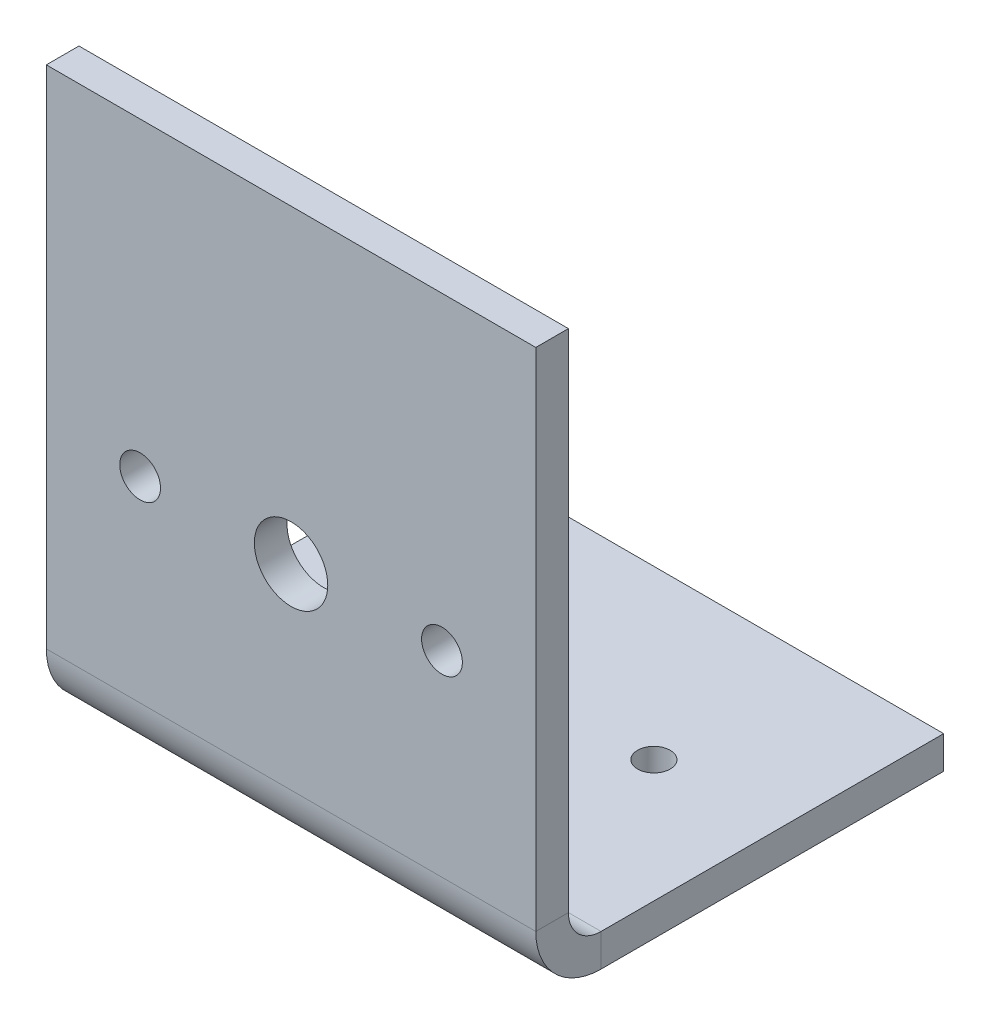
ISO-10303-21;
HEADER;
FILE_DESCRIPTION(('STEP AP214'),'2;1');
FILE_NAME('part.step','',(''),(''),'','','');
FILE_SCHEMA(('AUTOMOTIVE_DESIGN { 1 0 10303 214 1 1 1 1 }'));
ENDSEC;
DATA;
#1=APPLICATION_CONTEXT('core data for automotive mechanical design processes');
#2=APPLICATION_PROTOCOL_DEFINITION('international standard','automotive_design',2000,#1);
#3=PRODUCT_CONTEXT('',#1,'mechanical');
#4=PRODUCT('Part','Part','',(#3));
#5=PRODUCT_RELATED_PRODUCT_CATEGORY('part','',(#4));
#6=PRODUCT_DEFINITION_FORMATION('','',#4);
#7=PRODUCT_DEFINITION_CONTEXT('part definition',#1,'design');
#8=PRODUCT_DEFINITION('design','',#6,#7);
#9=PRODUCT_DEFINITION_SHAPE('','',#8);
#10=(LENGTH_UNIT() NAMED_UNIT(*) SI_UNIT(.MILLI.,.METRE.));
#11=(NAMED_UNIT(*) PLANE_ANGLE_UNIT() SI_UNIT($,.RADIAN.));
#12=(NAMED_UNIT(*) SI_UNIT($,.STERADIAN.) SOLID_ANGLE_UNIT());
#13=UNCERTAINTY_MEASURE_WITH_UNIT(LENGTH_MEASURE(1.E-05),#10,'distance_accuracy_value','');
#14=(GEOMETRIC_REPRESENTATION_CONTEXT(3) GLOBAL_UNCERTAINTY_ASSIGNED_CONTEXT((#13)) GLOBAL_UNIT_ASSIGNED_CONTEXT((#10,
#11,#12)) REPRESENTATION_CONTEXT('',''));
#15=CARTESIAN_POINT('',(0.,0.,0.));
#16=DIRECTION('',(0.,0.,1.));
#17=DIRECTION('',(1.,0.,0.));
#18=AXIS2_PLACEMENT_3D('',#15,#16,#17);
#19=CARTESIAN_POINT('',(0.,70.,-4.));
#20=DIRECTION('',(1.,0.,0.));
#21=DIRECTION('',(0.,1.,0.));
#22=AXIS2_PLACEMENT_3D('',#19,#20,#21);
#23=PLANE('',#22);
#24=DIRECTION('',(0.,0.,-1.));
#25=VECTOR('',#24,1.);
#26=CARTESIAN_POINT('',(0.,8.,-4.));
#27=LINE('',#26,#25);
#28=CARTESIAN_POINT('',(0.,8.,0.));
#29=VERTEX_POINT('',#28);
#30=CARTESIAN_POINT('',(0.,8.,-4.));
#31=VERTEX_POINT('',#30);
#32=EDGE_CURVE('E11',#29,#31,#27,.T.);
#33=ORIENTED_EDGE('',*,*,#32,.F.);
#34=DIRECTION('',(0.,-1.,0.));
#35=VECTOR('',#34,1.);
#36=CARTESIAN_POINT('',(0.,70.,0.));
#37=LINE('',#36,#35);
#38=CARTESIAN_POINT('',(0.,70.,0.));
#39=VERTEX_POINT('',#38);
#40=EDGE_CURVE('E92',#29,#39,#37,.F.);
#41=ORIENTED_EDGE('',*,*,#40,.T.);
#42=DIRECTION('',(0.,0.,-1.));
#43=VECTOR('',#42,1.);
#44=CARTESIAN_POINT('',(0.,70.,-4.));
#45=LINE('',#44,#43);
#46=CARTESIAN_POINT('',(0.,70.,-4.));
#47=VERTEX_POINT('',#46);
#48=EDGE_CURVE('E51',#39,#47,#45,.T.);
#49=ORIENTED_EDGE('',*,*,#48,.T.);
#50=DIRECTION('',(0.,1.,0.));
#51=VECTOR('',#50,1.);
#52=CARTESIAN_POINT('',(0.,70.,-4.));
#53=LINE('',#52,#51);
#54=EDGE_CURVE('E95',#31,#47,#53,.T.);
#55=ORIENTED_EDGE('',*,*,#54,.F.);
#56=EDGE_LOOP('',(#33,#41,#49,#55));
#57=FACE_BOUND('',#56,.T.);
#58=ADVANCED_FACE('F40',(#57),#23,.F.);
#59=CARTESIAN_POINT('',(60.,70.,-4.));
#60=DIRECTION('',(0.,1.,0.));
#61=DIRECTION('',(-1.,0.,0.));
#62=AXIS2_PLACEMENT_3D('',#59,#60,#61);
#63=PLANE('',#62);
#64=ORIENTED_EDGE('',*,*,#48,.F.);
#65=DIRECTION('',(1.,0.,0.));
#66=VECTOR('',#65,1.);
#67=CARTESIAN_POINT('',(60.,70.,0.));
#68=LINE('',#67,#66);
#69=CARTESIAN_POINT('',(60.,70.,0.));
#70=VERTEX_POINT('',#69);
#71=EDGE_CURVE('E121',#70,#39,#68,.F.);
#72=ORIENTED_EDGE('',*,*,#71,.F.);
#73=DIRECTION('',(0.,0.,-1.));
#74=VECTOR('',#73,1.);
#75=CARTESIAN_POINT('',(60.,70.,-4.));
#76=LINE('',#75,#74);
#77=CARTESIAN_POINT('',(60.,70.,-4.));
#78=VERTEX_POINT('',#77);
#79=EDGE_CURVE('E153',#70,#78,#76,.T.);
#80=ORIENTED_EDGE('',*,*,#79,.T.);
#81=DIRECTION('',(-1.,0.,0.));
#82=VECTOR('',#81,1.);
#83=CARTESIAN_POINT('',(60.,70.,-4.));
#84=LINE('',#83,#82);
#85=EDGE_CURVE('E202',#78,#47,#84,.T.);
#86=ORIENTED_EDGE('',*,*,#85,.T.);
#87=EDGE_LOOP('',(#64,#72,#80,#86));
#88=FACE_BOUND('',#87,.T.);
#89=ADVANCED_FACE('F278',(#88),#63,.T.);
#90=CARTESIAN_POINT('',(60.,70.,-4.));
#91=DIRECTION('',(1.,0.,0.));
#92=DIRECTION('',(0.,1.,0.));
#93=AXIS2_PLACEMENT_3D('',#90,#91,#92);
#94=PLANE('',#93);
#95=ORIENTED_EDGE('',*,*,#79,.F.);
#96=DIRECTION('',(0.,-1.,0.));
#97=VECTOR('',#96,1.);
#98=CARTESIAN_POINT('',(60.,70.,0.));
#99=LINE('',#98,#97);
#100=CARTESIAN_POINT('',(60.,8.,0.));
#101=VERTEX_POINT('',#100);
#102=EDGE_CURVE('E240',#101,#70,#99,.F.);
#103=ORIENTED_EDGE('',*,*,#102,.F.);
#104=DIRECTION('',(0.,0.,-1.));
#105=VECTOR('',#104,1.);
#106=CARTESIAN_POINT('',(60.,8.,-4.));
#107=LINE('',#106,#105);
#108=CARTESIAN_POINT('',(60.,8.,-4.));
#109=VERTEX_POINT('',#108);
#110=EDGE_CURVE('E149',#101,#109,#107,.T.);
#111=ORIENTED_EDGE('',*,*,#110,.T.);
#112=DIRECTION('',(0.,1.,0.));
#113=VECTOR('',#112,1.);
#114=CARTESIAN_POINT('',(60.,70.,-4.));
#115=LINE('',#114,#113);
#116=EDGE_CURVE('E207',#109,#78,#115,.T.);
#117=ORIENTED_EDGE('',*,*,#116,.T.);
#118=EDGE_LOOP('',(#95,#103,#111,#117));
#119=FACE_BOUND('',#118,.T.);
#120=ADVANCED_FACE('F313',(#119),#94,.T.);
#121=CARTESIAN_POINT('',(60.,8.,-8.00000000000001));
#122=DIRECTION('',(1.,0.,0.));
#123=DIRECTION('',(0.,0.,-1.));
#124=AXIS2_PLACEMENT_3D('',#121,#122,#123);
#125=PLANE('',#124);
#126=ORIENTED_EDGE('',*,*,#110,.F.);
#127=CARTESIAN_POINT('',(60.,8.,-8.00000000000001));
#128=DIRECTION('',(1.,0.,0.));
#129=DIRECTION('',(0.,0.,-1.));
#130=AXIS2_PLACEMENT_3D('',#127,#128,#129);
#131=CIRCLE('',#130,8.);
#132=CARTESIAN_POINT('',(60.,0.,-8.));
#133=VERTEX_POINT('',#132);
#134=EDGE_CURVE('E110',#101,#133,#131,.T.);
#135=ORIENTED_EDGE('',*,*,#134,.T.);
#136=DIRECTION('',(0.,1.,0.));
#137=VECTOR('',#136,1.);
#138=CARTESIAN_POINT('',(60.,4.,-8.00000000000001));
#139=LINE('',#138,#137);
#140=CARTESIAN_POINT('',(60.,4.,-8.00000000000001));
#141=VERTEX_POINT('',#140);
#142=EDGE_CURVE('E60',#133,#141,#139,.T.);
#143=ORIENTED_EDGE('',*,*,#142,.T.);
#144=CARTESIAN_POINT('',(60.,8.,-8.00000000000001));
#145=DIRECTION('',(-1.,0.,0.));
#146=DIRECTION('',(0.,0.,1.));
#147=AXIS2_PLACEMENT_3D('',#144,#145,#146);
#148=CIRCLE('',#147,4.);
#149=EDGE_CURVE('E203',#109,#141,#148,.F.);
#150=ORIENTED_EDGE('',*,*,#149,.F.);
#151=EDGE_LOOP('',(#126,#135,#143,#150));
#152=FACE_BOUND('',#151,.T.);
#153=ADVANCED_FACE('F311',(#152),#125,.T.);
#154=CARTESIAN_POINT('',(60.,4.,-4.00000000000001));
#155=DIRECTION('',(1.,0.,0.));
#156=DIRECTION('',(0.,0.,1.));
#157=AXIS2_PLACEMENT_3D('',#154,#155,#156);
#158=PLANE('',#157);
#159=ORIENTED_EDGE('',*,*,#142,.F.);
#160=DIRECTION('',(0.,0.,-1.));
#161=VECTOR('',#160,1.);
#162=CARTESIAN_POINT('',(60.,0.,-4.00000000000001));
#163=LINE('',#162,#161);
#164=CARTESIAN_POINT('',(60.,0.,-50.));
#165=VERTEX_POINT('',#164);
#166=EDGE_CURVE('E239',#165,#133,#163,.F.);
#167=ORIENTED_EDGE('',*,*,#166,.F.);
#168=DIRECTION('',(0.,1.,0.));
#169=VECTOR('',#168,1.);
#170=CARTESIAN_POINT('',(60.,4.,-50.));
#171=LINE('',#170,#169);
#172=CARTESIAN_POINT('',(60.,4.,-50.));
#173=VERTEX_POINT('',#172);
#174=EDGE_CURVE('E143',#165,#173,#171,.T.);
#175=ORIENTED_EDGE('',*,*,#174,.T.);
#176=DIRECTION('',(0.,0.,1.));
#177=VECTOR('',#176,1.);
#178=CARTESIAN_POINT('',(60.,4.,-4.00000000000001));
#179=LINE('',#178,#177);
#180=EDGE_CURVE('E215',#173,#141,#179,.T.);
#181=ORIENTED_EDGE('',*,*,#180,.T.);
#182=EDGE_LOOP('',(#159,#167,#175,#181));
#183=FACE_BOUND('',#182,.T.);
#184=ADVANCED_FACE('F298',(#183),#158,.T.);
#185=CARTESIAN_POINT('',(60.,4.,-50.));
#186=DIRECTION('',(0.,0.,1.));
#187=DIRECTION('',(-1.,0.,0.));
#188=AXIS2_PLACEMENT_3D('',#185,#186,#187);
#189=PLANE('',#188);
#190=ORIENTED_EDGE('',*,*,#174,.F.);
#191=DIRECTION('',(1.,0.,0.));
#192=VECTOR('',#191,1.);
#193=CARTESIAN_POINT('',(60.,0.,-50.));
#194=LINE('',#193,#192);
#195=CARTESIAN_POINT('',(0.,0.,-50.));
#196=VERTEX_POINT('',#195);
#197=EDGE_CURVE('E116',#165,#196,#194,.F.);
#198=ORIENTED_EDGE('',*,*,#197,.T.);
#199=DIRECTION('',(0.,1.,0.));
#200=VECTOR('',#199,1.);
#201=CARTESIAN_POINT('',(0.,4.,-50.));
#202=LINE('',#201,#200);
#203=CARTESIAN_POINT('',(0.,4.,-50.));
#204=VERTEX_POINT('',#203);
#205=EDGE_CURVE('E139',#196,#204,#202,.T.);
#206=ORIENTED_EDGE('',*,*,#205,.T.);
#207=DIRECTION('',(-1.,0.,0.));
#208=VECTOR('',#207,1.);
#209=CARTESIAN_POINT('',(60.,4.,-50.));
#210=LINE('',#209,#208);
#211=EDGE_CURVE('E219',#173,#204,#210,.T.);
#212=ORIENTED_EDGE('',*,*,#211,.F.);
#213=EDGE_LOOP('',(#190,#198,#206,#212));
#214=FACE_BOUND('',#213,.T.);
#215=ADVANCED_FACE('F304',(#214),#189,.F.);
#216=CARTESIAN_POINT('',(0.,4.,-4.00000000000001));
#217=DIRECTION('',(1.,0.,0.));
#218=DIRECTION('',(0.,0.,1.));
#219=AXIS2_PLACEMENT_3D('',#216,#217,#218);
#220=PLANE('',#219);
#221=ORIENTED_EDGE('',*,*,#205,.F.);
#222=DIRECTION('',(0.,0.,-1.));
#223=VECTOR('',#222,1.);
#224=CARTESIAN_POINT('',(0.,0.,-4.00000000000001));
#225=LINE('',#224,#223);
#226=CARTESIAN_POINT('',(0.,0.,-8.00000000000001));
#227=VERTEX_POINT('',#226);
#228=EDGE_CURVE('E236',#196,#227,#225,.F.);
#229=ORIENTED_EDGE('',*,*,#228,.T.);
#230=DIRECTION('',(0.,1.,0.));
#231=VECTOR('',#230,1.);
#232=CARTESIAN_POINT('',(0.,4.,-8.00000000000001));
#233=LINE('',#232,#231);
#234=CARTESIAN_POINT('',(0.,4.,-8.00000000000001));
#235=VERTEX_POINT('',#234);
#236=EDGE_CURVE('E125',#227,#235,#233,.T.);
#237=ORIENTED_EDGE('',*,*,#236,.T.);
#238=DIRECTION('',(0.,0.,1.));
#239=VECTOR('',#238,1.);
#240=CARTESIAN_POINT('',(0.,4.,-4.00000000000001));
#241=LINE('',#240,#239);
#242=EDGE_CURVE('E211',#204,#235,#241,.T.);
#243=ORIENTED_EDGE('',*,*,#242,.F.);
#244=EDGE_LOOP('',(#221,#229,#237,#243));
#245=FACE_BOUND('',#244,.T.);
#246=ADVANCED_FACE('F308',(#245),#220,.F.);
#247=CARTESIAN_POINT('',(0.,8.,-8.00000000000001));
#248=DIRECTION('',(-1.,0.,0.));
#249=DIRECTION('',(0.,0.,1.));
#250=AXIS2_PLACEMENT_3D('',#247,#248,#249);
#251=PLANE('',#250);
#252=CARTESIAN_POINT('',(0.,8.,-8.00000000000001));
#253=DIRECTION('',(1.,0.,0.));
#254=DIRECTION('',(0.,0.,-1.));
#255=AXIS2_PLACEMENT_3D('',#252,#253,#254);
#256=CIRCLE('',#255,8.);
#257=EDGE_CURVE('E108',#227,#29,#256,.F.);
#258=ORIENTED_EDGE('',*,*,#257,.T.);
#259=ORIENTED_EDGE('',*,*,#32,.T.);
#260=CARTESIAN_POINT('',(0.,8.,-8.00000000000001));
#261=DIRECTION('',(1.,0.,0.));
#262=DIRECTION('',(0.,0.,-1.));
#263=AXIS2_PLACEMENT_3D('',#260,#261,#262);
#264=CIRCLE('',#263,4.);
#265=EDGE_CURVE('E229',#235,#31,#264,.F.);
#266=ORIENTED_EDGE('',*,*,#265,.F.);
#267=ORIENTED_EDGE('',*,*,#236,.F.);
#268=EDGE_LOOP('',(#258,#259,#266,#267));
#269=FACE_BOUND('',#268,.T.);
#270=ADVANCED_FACE('F42',(#269),#251,.T.);
#271=CARTESIAN_POINT('',(60.,4.,-4.00000000000001));
#272=DIRECTION('',(0.,-1.,0.));
#273=DIRECTION('',(0.,0.,-1.));
#274=AXIS2_PLACEMENT_3D('',#271,#272,#273);
#275=PLANE('',#274);
#276=CARTESIAN_POINT('',(45.,4.,-29.4766775514744));
#277=DIRECTION('',(0.,-1.,0.));
#278=DIRECTION('',(0.,0.,1.));
#279=AXIS2_PLACEMENT_3D('',#276,#277,#278);
#280=CIRCLE('',#279,2.);
#281=CARTESIAN_POINT('',(45.,4.,-27.4766775514744));
#282=VERTEX_POINT('',#281);
#283=EDGE_CURVE('E166',#282,#282,#280,.T.);
#284=ORIENTED_EDGE('',*,*,#283,.T.);
#285=EDGE_LOOP('',(#284));
#286=FACE_BOUND('',#285,.T.);
#287=CARTESIAN_POINT('',(15.,4.,-29.4766775514744));
#288=DIRECTION('',(0.,1.,0.));
#289=DIRECTION('',(0.,0.,1.));
#290=AXIS2_PLACEMENT_3D('',#287,#288,#289);
#291=CIRCLE('',#290,2.);
#292=CARTESIAN_POINT('',(15.,4.,-27.4766775514744));
#293=VERTEX_POINT('',#292);
#294=EDGE_CURVE('E135',#293,#293,#291,.T.);
#295=ORIENTED_EDGE('',*,*,#294,.F.);
#296=EDGE_LOOP('',(#295));
#297=FACE_BOUND('',#296,.T.);
#298=ORIENTED_EDGE('',*,*,#242,.T.);
#299=DIRECTION('',(-1.,0.,0.));
#300=VECTOR('',#299,1.);
#301=CARTESIAN_POINT('',(60.,4.,-8.00000000000001));
#302=LINE('',#301,#300);
#303=EDGE_CURVE('E160',#235,#141,#302,.F.);
#304=ORIENTED_EDGE('',*,*,#303,.T.);
#305=ORIENTED_EDGE('',*,*,#180,.F.);
#306=ORIENTED_EDGE('',*,*,#211,.T.);
#307=EDGE_LOOP('',(#298,#304,#305,#306));
#308=FACE_BOUND('',#307,.T.);
#309=ADVANCED_FACE('F303',(#286,#297,#308),#275,.F.);
#310=CARTESIAN_POINT('',(60.,70.,-4.));
#311=DIRECTION('',(0.,0.,1.));
#312=DIRECTION('',(0.,-1.,0.));
#313=AXIS2_PLACEMENT_3D('',#310,#311,#312);
#314=PLANE('',#313);
#315=CARTESIAN_POINT('',(48.4999026659366,32.0600112562022,-4.));
#316=DIRECTION('',(0.,0.,-1.));
#317=DIRECTION('',(0.,1.,0.));
#318=AXIS2_PLACEMENT_3D('',#315,#316,#317);
#319=CIRCLE('',#318,2.5);
#320=CARTESIAN_POINT('',(48.4999026659366,34.5600112562022,-4.));
#321=VERTEX_POINT('',#320);
#322=EDGE_CURVE('E174',#321,#321,#319,.T.);
#323=ORIENTED_EDGE('',*,*,#322,.F.);
#324=EDGE_LOOP('',(#323));
#325=FACE_BOUND('',#324,.T.);
#326=CARTESIAN_POINT('',(11.5,32.0600112562022,-4.));
#327=DIRECTION('',(0.,0.,-1.));
#328=DIRECTION('',(0.,1.,0.));
#329=AXIS2_PLACEMENT_3D('',#326,#327,#328);
#330=CIRCLE('',#329,2.5);
#331=CARTESIAN_POINT('',(11.5,34.5600112562022,-4.));
#332=VERTEX_POINT('',#331);
#333=EDGE_CURVE('E182',#332,#332,#330,.T.);
#334=ORIENTED_EDGE('',*,*,#333,.F.);
#335=EDGE_LOOP('',(#334));
#336=FACE_BOUND('',#335,.T.);
#337=CARTESIAN_POINT('',(30.,32.,-4.));
#338=DIRECTION('',(0.,0.,-1.));
#339=DIRECTION('',(0.,1.,0.));
#340=AXIS2_PLACEMENT_3D('',#337,#338,#339);
#341=CIRCLE('',#340,4.50000000000001);
#342=CARTESIAN_POINT('',(30.,36.5,-4.));
#343=VERTEX_POINT('',#342);
#344=EDGE_CURVE('E170',#343,#343,#341,.T.);
#345=ORIENTED_EDGE('',*,*,#344,.F.);
#346=EDGE_LOOP('',(#345));
#347=FACE_BOUND('',#346,.T.);
#348=ORIENTED_EDGE('',*,*,#116,.F.);
#349=DIRECTION('',(-1.,0.,0.));
#350=VECTOR('',#349,1.);
#351=CARTESIAN_POINT('',(0.,8.,-4.));
#352=LINE('',#351,#350);
#353=EDGE_CURVE('E223',#109,#31,#352,.T.);
#354=ORIENTED_EDGE('',*,*,#353,.T.);
#355=ORIENTED_EDGE('',*,*,#54,.T.);
#356=ORIENTED_EDGE('',*,*,#85,.F.);
#357=EDGE_LOOP('',(#348,#354,#355,#356));
#358=FACE_BOUND('',#357,.T.);
#359=ADVANCED_FACE('F284',(#325,#336,#347,#358),#314,.F.);
#360=CARTESIAN_POINT('',(60.,8.,-8.00000000000001));
#361=DIRECTION('',(1.,0.,0.));
#362=DIRECTION('',(0.,0.,-1.));
#363=AXIS2_PLACEMENT_3D('',#360,#361,#362);
#364=CYLINDRICAL_SURFACE('',#363,4.);
#365=ORIENTED_EDGE('',*,*,#149,.T.);
#366=ORIENTED_EDGE('',*,*,#303,.F.);
#367=ORIENTED_EDGE('',*,*,#265,.T.);
#368=ORIENTED_EDGE('',*,*,#353,.F.);
#369=EDGE_LOOP('',(#365,#366,#367,#368));
#370=FACE_BOUND('',#369,.T.);
#371=ADVANCED_FACE('F289',(#370),#364,.F.);
#372=CARTESIAN_POINT('',(60.,0.,-4.00000000000001));
#373=DIRECTION('',(0.,-1.,0.));
#374=DIRECTION('',(0.,0.,-1.));
#375=AXIS2_PLACEMENT_3D('',#372,#373,#374);
#376=PLANE('',#375);
#377=CARTESIAN_POINT('',(45.,0.,-29.4766775514744));
#378=DIRECTION('',(0.,-1.,0.));
#379=DIRECTION('',(0.,0.,-1.));
#380=AXIS2_PLACEMENT_3D('',#377,#378,#379);
#381=CIRCLE('',#380,2.);
#382=CARTESIAN_POINT('',(45.,0.,-31.4766775514744));
#383=VERTEX_POINT('',#382);
#384=EDGE_CURVE('E162',#383,#383,#381,.F.);
#385=ORIENTED_EDGE('',*,*,#384,.T.);
#386=EDGE_LOOP('',(#385));
#387=FACE_BOUND('',#386,.T.);
#388=CARTESIAN_POINT('',(15.,0.,-29.4766775514744));
#389=DIRECTION('',(0.,-1.,0.));
#390=DIRECTION('',(0.,0.,-1.));
#391=AXIS2_PLACEMENT_3D('',#388,#389,#390);
#392=CIRCLE('',#391,2.);
#393=CARTESIAN_POINT('',(15.,0.,-31.4766775514744));
#394=VERTEX_POINT('',#393);
#395=EDGE_CURVE('E128',#394,#394,#392,.T.);
#396=ORIENTED_EDGE('',*,*,#395,.F.);
#397=EDGE_LOOP('',(#396));
#398=FACE_BOUND('',#397,.T.);
#399=ORIENTED_EDGE('',*,*,#228,.F.);
#400=ORIENTED_EDGE('',*,*,#197,.F.);
#401=ORIENTED_EDGE('',*,*,#166,.T.);
#402=DIRECTION('',(1.,0.,0.));
#403=VECTOR('',#402,1.);
#404=CARTESIAN_POINT('',(60.,0.,-8.00000000000001));
#405=LINE('',#404,#403);
#406=EDGE_CURVE('E115',#227,#133,#405,.T.);
#407=ORIENTED_EDGE('',*,*,#406,.F.);
#408=EDGE_LOOP('',(#399,#400,#401,#407));
#409=FACE_BOUND('',#408,.T.);
#410=ADVANCED_FACE('F310',(#387,#398,#409),#376,.T.);
#411=CARTESIAN_POINT('',(60.,70.,0.));
#412=DIRECTION('',(0.,0.,1.));
#413=DIRECTION('',(0.,-1.,0.));
#414=AXIS2_PLACEMENT_3D('',#411,#412,#413);
#415=PLANE('',#414);
#416=CARTESIAN_POINT('',(48.4999026659366,32.0600112562022,0.));
#417=DIRECTION('',(0.,0.,1.));
#418=DIRECTION('',(0.,-1.,0.));
#419=AXIS2_PLACEMENT_3D('',#416,#417,#418);
#420=CIRCLE('',#419,2.5);
#421=CARTESIAN_POINT('',(48.4999026659366,29.5600112562022,0.));
#422=VERTEX_POINT('',#421);
#423=EDGE_CURVE('E44',#422,#422,#420,.T.);
#424=ORIENTED_EDGE('',*,*,#423,.F.);
#425=EDGE_LOOP('',(#424));
#426=FACE_BOUND('',#425,.T.);
#427=CARTESIAN_POINT('',(11.5,32.0600112562022,0.));
#428=DIRECTION('',(0.,0.,1.));
#429=DIRECTION('',(0.,-1.,0.));
#430=AXIS2_PLACEMENT_3D('',#427,#428,#429);
#431=CIRCLE('',#430,2.5);
#432=CARTESIAN_POINT('',(11.5,29.5600112562022,0.));
#433=VERTEX_POINT('',#432);
#434=EDGE_CURVE('E171',#433,#433,#431,.T.);
#435=ORIENTED_EDGE('',*,*,#434,.F.);
#436=EDGE_LOOP('',(#435));
#437=FACE_BOUND('',#436,.T.);
#438=CARTESIAN_POINT('',(30.,32.,0.));
#439=DIRECTION('',(0.,0.,1.));
#440=DIRECTION('',(0.,-1.,0.));
#441=AXIS2_PLACEMENT_3D('',#438,#439,#440);
#442=CIRCLE('',#441,4.50000000000001);
#443=CARTESIAN_POINT('',(30.,27.5,0.));
#444=VERTEX_POINT('',#443);
#445=EDGE_CURVE('E167',#444,#444,#442,.T.);
#446=ORIENTED_EDGE('',*,*,#445,.F.);
#447=EDGE_LOOP('',(#446));
#448=FACE_BOUND('',#447,.T.);
#449=ORIENTED_EDGE('',*,*,#102,.T.);
#450=ORIENTED_EDGE('',*,*,#71,.T.);
#451=ORIENTED_EDGE('',*,*,#40,.F.);
#452=DIRECTION('',(1.,0.,0.));
#453=VECTOR('',#452,1.);
#454=CARTESIAN_POINT('',(60.,8.,0.));
#455=LINE('',#454,#453);
#456=EDGE_CURVE('E105',#101,#29,#455,.F.);
#457=ORIENTED_EDGE('',*,*,#456,.F.);
#458=EDGE_LOOP('',(#449,#450,#451,#457));
#459=FACE_BOUND('',#458,.T.);
#460=ADVANCED_FACE('F119',(#426,#437,#448,#459),#415,.T.);
#461=CARTESIAN_POINT('',(60.,8.,-8.00000000000001));
#462=DIRECTION('',(1.,0.,0.));
#463=DIRECTION('',(0.,0.,-1.));
#464=AXIS2_PLACEMENT_3D('',#461,#462,#463);
#465=CYLINDRICAL_SURFACE('',#464,8.);
#466=ORIENTED_EDGE('',*,*,#134,.F.);
#467=ORIENTED_EDGE('',*,*,#456,.T.);
#468=ORIENTED_EDGE('',*,*,#257,.F.);
#469=ORIENTED_EDGE('',*,*,#406,.T.);
#470=EDGE_LOOP('',(#466,#467,#468,#469));
#471=FACE_BOUND('',#470,.T.);
#472=ADVANCED_FACE('F106',(#471),#465,.T.);
#473=CARTESIAN_POINT('',(15.,-56.,-29.4766775514744));
#474=DIRECTION('',(0.,1.,0.));
#475=DIRECTION('',(0.,0.,1.));
#476=AXIS2_PLACEMENT_3D('',#473,#474,#475);
#477=CYLINDRICAL_SURFACE('',#476,2.);
#478=ORIENTED_EDGE('',*,*,#395,.T.);
#479=EDGE_LOOP('',(#478));
#480=FACE_BOUND('',#479,.T.);
#481=ORIENTED_EDGE('',*,*,#294,.T.);
#482=EDGE_LOOP('',(#481));
#483=FACE_BOUND('',#482,.T.);
#484=ADVANCED_FACE('F431',(#480,#483),#477,.F.);
#485=CARTESIAN_POINT('',(45.,-56.,-29.4766775514744));
#486=DIRECTION('',(0.,1.,0.));
#487=DIRECTION('',(0.,0.,1.));
#488=AXIS2_PLACEMENT_3D('',#485,#486,#487);
#489=CYLINDRICAL_SURFACE('',#488,2.);
#490=ORIENTED_EDGE('',*,*,#384,.F.);
#491=EDGE_LOOP('',(#490));
#492=FACE_BOUND('',#491,.T.);
#493=ORIENTED_EDGE('',*,*,#283,.F.);
#494=EDGE_LOOP('',(#493));
#495=FACE_BOUND('',#494,.T.);
#496=ADVANCED_FACE('F438',(#492,#495),#489,.F.);
#497=CARTESIAN_POINT('',(30.,32.,6.));
#498=DIRECTION('',(0.,0.,-1.));
#499=DIRECTION('',(0.,1.,0.));
#500=AXIS2_PLACEMENT_3D('',#497,#498,#499);
#501=CYLINDRICAL_SURFACE('',#500,4.50000000000001);
#502=ORIENTED_EDGE('',*,*,#445,.T.);
#503=EDGE_LOOP('',(#502));
#504=FACE_BOUND('',#503,.T.);
#505=ORIENTED_EDGE('',*,*,#344,.T.);
#506=EDGE_LOOP('',(#505));
#507=FACE_BOUND('',#506,.T.);
#508=ADVANCED_FACE('F447',(#504,#507),#501,.F.);
#509=CARTESIAN_POINT('',(11.5,32.0600112562022,6.));
#510=DIRECTION('',(0.,0.,-1.));
#511=DIRECTION('',(0.,1.,0.));
#512=AXIS2_PLACEMENT_3D('',#509,#510,#511);
#513=CYLINDRICAL_SURFACE('',#512,2.5);
#514=ORIENTED_EDGE('',*,*,#434,.T.);
#515=EDGE_LOOP('',(#514));
#516=FACE_BOUND('',#515,.T.);
#517=ORIENTED_EDGE('',*,*,#333,.T.);
#518=EDGE_LOOP('',(#517));
#519=FACE_BOUND('',#518,.T.);
#520=ADVANCED_FACE('F456',(#516,#519),#513,.F.);
#521=CARTESIAN_POINT('',(48.4999026659366,32.0600112562022,6.));
#522=DIRECTION('',(0.,0.,-1.));
#523=DIRECTION('',(0.,1.,0.));
#524=AXIS2_PLACEMENT_3D('',#521,#522,#523);
#525=CYLINDRICAL_SURFACE('',#524,2.5);
#526=ORIENTED_EDGE('',*,*,#423,.T.);
#527=EDGE_LOOP('',(#526));
#528=FACE_BOUND('',#527,.T.);
#529=ORIENTED_EDGE('',*,*,#322,.T.);
#530=EDGE_LOOP('',(#529));
#531=FACE_BOUND('',#530,.T.);
#532=ADVANCED_FACE('F465',(#528,#531),#525,.F.);
#533=CLOSED_SHELL('',(#58,#89,#120,#153,#184,#215,#246,#270,#309,#359,#371,#410,#460,#472,#484,
#496,#508,#520,#532));
#534=MANIFOLD_SOLID_BREP('B2',#533);
#535=ADVANCED_BREP_SHAPE_REPRESENTATION('',(#18,#534),#14);
#536=SHAPE_DEFINITION_REPRESENTATION(#9,#535);
ENDSEC;
END-ISO-10303-21;
